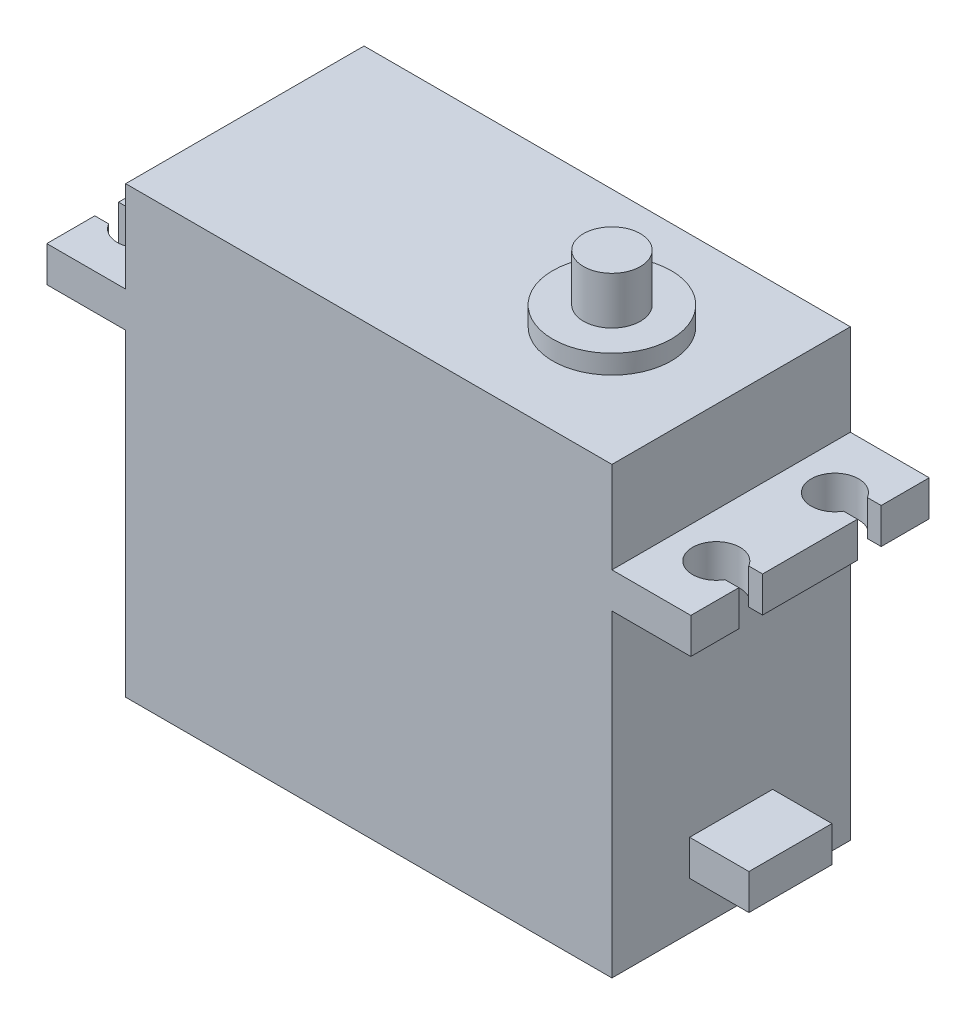
ISO-10303-21;
HEADER;
FILE_DESCRIPTION(('STEP AP214'),'2;1');
FILE_NAME('part.step','',(''),(''),'','','');
FILE_SCHEMA(('AUTOMOTIVE_DESIGN { 1 0 10303 214 1 1 1 1 }'));
ENDSEC;
DATA;
#1=APPLICATION_CONTEXT('core data for automotive mechanical design processes');
#2=APPLICATION_PROTOCOL_DEFINITION('international standard','automotive_design',2000,#1);
#3=PRODUCT_CONTEXT('',#1,'mechanical');
#4=PRODUCT('Part','Part','',(#3));
#5=PRODUCT_RELATED_PRODUCT_CATEGORY('part','',(#4));
#6=PRODUCT_DEFINITION_FORMATION('','',#4);
#7=PRODUCT_DEFINITION_CONTEXT('part definition',#1,'design');
#8=PRODUCT_DEFINITION('design','',#6,#7);
#9=PRODUCT_DEFINITION_SHAPE('','',#8);
#10=(LENGTH_UNIT() NAMED_UNIT(*) SI_UNIT(.MILLI.,.METRE.));
#11=(NAMED_UNIT(*) PLANE_ANGLE_UNIT() SI_UNIT($,.RADIAN.));
#12=(NAMED_UNIT(*) SI_UNIT($,.STERADIAN.) SOLID_ANGLE_UNIT());
#13=UNCERTAINTY_MEASURE_WITH_UNIT(LENGTH_MEASURE(1.E-05),#10,'distance_accuracy_value','');
#14=(GEOMETRIC_REPRESENTATION_CONTEXT(3) GLOBAL_UNCERTAINTY_ASSIGNED_CONTEXT((#13)) GLOBAL_UNIT_ASSIGNED_CONTEXT((#10,
#11,#12)) REPRESENTATION_CONTEXT('',''));
#15=CARTESIAN_POINT('',(0.,0.,0.));
#16=DIRECTION('',(0.,0.,1.));
#17=DIRECTION('',(1.,0.,0.));
#18=AXIS2_PLACEMENT_3D('',#15,#16,#17);
#19=CARTESIAN_POINT('',(10.05,26.8,10.05));
#20=DIRECTION('',(-1.,0.,0.));
#21=DIRECTION('',(0.,-1.,0.));
#22=AXIS2_PLACEMENT_3D('',#19,#20,#21);
#23=PLANE('',#22);
#24=DIRECTION('',(0.,1.,0.));
#25=VECTOR('',#24,1.);
#26=CARTESIAN_POINT('',(10.05,26.8,-10.05));
#27=LINE('',#26,#25);
#28=CARTESIAN_POINT('',(10.05,0.,-10.05));
#29=VERTEX_POINT('',#28);
#30=CARTESIAN_POINT('',(10.05,26.8,-10.05));
#31=VERTEX_POINT('',#30);
#32=EDGE_CURVE('E395',#29,#31,#27,.T.);
#33=ORIENTED_EDGE('',*,*,#32,.T.);
#34=DIRECTION('',(0.,0.,-1.));
#35=VECTOR('',#34,1.);
#36=CARTESIAN_POINT('',(10.05,26.8,10.05));
#37=LINE('',#36,#35);
#38=CARTESIAN_POINT('',(10.05,26.8,10.05));
#39=VERTEX_POINT('',#38);
#40=EDGE_CURVE('E456',#39,#31,#37,.T.);
#41=ORIENTED_EDGE('',*,*,#40,.F.);
#42=DIRECTION('',(0.,1.,0.));
#43=VECTOR('',#42,1.);
#44=CARTESIAN_POINT('',(10.05,26.8,10.05));
#45=LINE('',#44,#43);
#46=CARTESIAN_POINT('',(10.05,0.,10.05));
#47=VERTEX_POINT('',#46);
#48=EDGE_CURVE('E369',#47,#39,#45,.T.);
#49=ORIENTED_EDGE('',*,*,#48,.F.);
#50=DIRECTION('',(0.,0.,-1.));
#51=VECTOR('',#50,1.);
#52=CARTESIAN_POINT('',(10.05,0.,10.05));
#53=LINE('',#52,#51);
#54=EDGE_CURVE('E460',#47,#29,#53,.T.);
#55=ORIENTED_EDGE('',*,*,#54,.T.);
#56=EDGE_LOOP('',(#33,#41,#49,#55));
#57=FACE_BOUND('',#56,.T.);
#58=DIRECTION('',(0.,-1.,0.));
#59=VECTOR('',#58,1.);
#60=CARTESIAN_POINT('',(10.05,7.,3.5));
#61=LINE('',#60,#59);
#62=CARTESIAN_POINT('',(10.05,7.,3.5));
#63=VERTEX_POINT('',#62);
#64=CARTESIAN_POINT('',(10.05,4.,3.5));
#65=VERTEX_POINT('',#64);
#66=EDGE_CURVE('E264',#63,#65,#61,.T.);
#67=ORIENTED_EDGE('',*,*,#66,.F.);
#68=DIRECTION('',(0.,0.,1.));
#69=VECTOR('',#68,1.);
#70=CARTESIAN_POINT('',(10.05,7.,3.5));
#71=LINE('',#70,#69);
#72=CARTESIAN_POINT('',(10.05,7.,-3.5));
#73=VERTEX_POINT('',#72);
#74=EDGE_CURVE('E261',#73,#63,#71,.T.);
#75=ORIENTED_EDGE('',*,*,#74,.F.);
#76=DIRECTION('',(0.,1.,0.));
#77=VECTOR('',#76,1.);
#78=CARTESIAN_POINT('',(10.05,7.,-3.5));
#79=LINE('',#78,#77);
#80=CARTESIAN_POINT('',(10.05,4.,-3.5));
#81=VERTEX_POINT('',#80);
#82=EDGE_CURVE('E55',#81,#73,#79,.T.);
#83=ORIENTED_EDGE('',*,*,#82,.F.);
#84=DIRECTION('',(0.,0.,-1.));
#85=VECTOR('',#84,1.);
#86=CARTESIAN_POINT('',(10.05,4.,3.5));
#87=LINE('',#86,#85);
#88=EDGE_CURVE('E50',#65,#81,#87,.T.);
#89=ORIENTED_EDGE('',*,*,#88,.F.);
#90=EDGE_LOOP('',(#67,#75,#83,#89));
#91=FACE_BOUND('',#90,.T.);
#92=ADVANCED_FACE('F35',(#57,#91),#23,.F.);
#93=CARTESIAN_POINT('',(0.,39.1,0.));
#94=DIRECTION('',(0.,1.,0.));
#95=DIRECTION('',(0.,0.,1.));
#96=AXIS2_PLACEMENT_3D('',#93,#94,#95);
#97=PLANE('',#96);
#98=CARTESIAN_POINT('',(0.,39.1,0.));
#99=DIRECTION('',(0.,1.,0.));
#100=DIRECTION('',(0.,0.,1.));
#101=AXIS2_PLACEMENT_3D('',#98,#99,#100);
#102=CIRCLE('',#101,5.);
#103=CARTESIAN_POINT('',(0.,39.1,5.));
#104=VERTEX_POINT('',#103);
#105=EDGE_CURVE('E275',#104,#104,#102,.T.);
#106=ORIENTED_EDGE('',*,*,#105,.T.);
#107=EDGE_LOOP('',(#106));
#108=FACE_BOUND('',#107,.T.);
#109=CARTESIAN_POINT('',(0.,39.1,0.));
#110=DIRECTION('',(0.,1.,0.));
#111=DIRECTION('',(0.,0.,1.));
#112=AXIS2_PLACEMENT_3D('',#109,#110,#111);
#113=CIRCLE('',#112,2.4);
#114=CARTESIAN_POINT('',(0.,39.1,2.4));
#115=VERTEX_POINT('',#114);
#116=EDGE_CURVE('E265',#115,#115,#113,.T.);
#117=ORIENTED_EDGE('',*,*,#116,.F.);
#118=EDGE_LOOP('',(#117));
#119=FACE_BOUND('',#118,.T.);
#120=ADVANCED_FACE('F550',(#108,#119),#97,.T.);
#121=CARTESIAN_POINT('',(-30.95,37.5,10.05));
#122=DIRECTION('',(0.,-1.,0.));
#123=DIRECTION('',(0.,0.,-1.));
#124=AXIS2_PLACEMENT_3D('',#121,#122,#123);
#125=PLANE('',#124);
#126=DIRECTION('',(-1.,0.,0.));
#127=VECTOR('',#126,1.);
#128=CARTESIAN_POINT('',(-30.95,37.5,-10.05));
#129=LINE('',#128,#127);
#130=CARTESIAN_POINT('',(10.05,37.5,-10.05));
#131=VERTEX_POINT('',#130);
#132=CARTESIAN_POINT('',(-30.95,37.5,-10.05));
#133=VERTEX_POINT('',#132);
#134=EDGE_CURVE('E407',#131,#133,#129,.T.);
#135=ORIENTED_EDGE('',*,*,#134,.T.);
#136=DIRECTION('',(0.,0.,-1.));
#137=VECTOR('',#136,1.);
#138=CARTESIAN_POINT('',(-30.95,37.5,10.05));
#139=LINE('',#138,#137);
#140=CARTESIAN_POINT('',(-30.95,37.5,10.05));
#141=VERTEX_POINT('',#140);
#142=EDGE_CURVE('E438',#141,#133,#139,.T.);
#143=ORIENTED_EDGE('',*,*,#142,.F.);
#144=DIRECTION('',(-1.,0.,0.));
#145=VECTOR('',#144,1.);
#146=CARTESIAN_POINT('',(-30.95,37.5,10.05));
#147=LINE('',#146,#145);
#148=CARTESIAN_POINT('',(10.05,37.5,10.05));
#149=VERTEX_POINT('',#148);
#150=EDGE_CURVE('E380',#149,#141,#147,.T.);
#151=ORIENTED_EDGE('',*,*,#150,.F.);
#152=DIRECTION('',(0.,0.,-1.));
#153=VECTOR('',#152,1.);
#154=CARTESIAN_POINT('',(10.05,37.5,10.05));
#155=LINE('',#154,#153);
#156=EDGE_CURVE('E441',#149,#131,#155,.T.);
#157=ORIENTED_EDGE('',*,*,#156,.T.);
#158=EDGE_LOOP('',(#135,#143,#151,#157));
#159=FACE_BOUND('',#158,.T.);
#160=CARTESIAN_POINT('',(0.,37.5,0.));
#161=DIRECTION('',(0.,-1.,0.));
#162=DIRECTION('',(0.,0.,-1.));
#163=AXIS2_PLACEMENT_3D('',#160,#161,#162);
#164=CIRCLE('',#163,5.);
#165=CARTESIAN_POINT('',(0.,37.5,-5.));
#166=VERTEX_POINT('',#165);
#167=EDGE_CURVE('E11',#166,#166,#164,.F.);
#168=ORIENTED_EDGE('',*,*,#167,.F.);
#169=EDGE_LOOP('',(#168));
#170=FACE_BOUND('',#169,.T.);
#171=ADVANCED_FACE('F555',(#159,#170),#125,.F.);
#172=CARTESIAN_POINT('',(16.7,29.8,10.05));
#173=DIRECTION('',(-1.,0.,0.));
#174=DIRECTION('',(0.,0.,1.));
#175=AXIS2_PLACEMENT_3D('',#172,#173,#174);
#176=PLANE('',#175);
#177=DIRECTION('',(0.,0.,-1.));
#178=VECTOR('',#177,1.);
#179=CARTESIAN_POINT('',(16.7,26.8,10.05));
#180=LINE('',#179,#178);
#181=CARTESIAN_POINT('',(16.7,26.8,3.99999999999999));
#182=VERTEX_POINT('',#181);
#183=CARTESIAN_POINT('',(16.7,26.8,-4.));
#184=VERTEX_POINT('',#183);
#185=EDGE_CURVE('E457',#182,#184,#180,.T.);
#186=ORIENTED_EDGE('',*,*,#185,.T.);
#187=DIRECTION('',(0.,1.,0.));
#188=VECTOR('',#187,1.);
#189=CARTESIAN_POINT('',(16.7,0.,-4.));
#190=LINE('',#189,#188);
#191=CARTESIAN_POINT('',(16.7,29.8,-4.));
#192=VERTEX_POINT('',#191);
#193=EDGE_CURVE('E288',#184,#192,#190,.T.);
#194=ORIENTED_EDGE('',*,*,#193,.T.);
#195=DIRECTION('',(0.,0.,-1.));
#196=VECTOR('',#195,1.);
#197=CARTESIAN_POINT('',(16.7,29.8,10.05));
#198=LINE('',#197,#196);
#199=CARTESIAN_POINT('',(16.7,29.8,4.));
#200=VERTEX_POINT('',#199);
#201=EDGE_CURVE('E452',#200,#192,#198,.T.);
#202=ORIENTED_EDGE('',*,*,#201,.F.);
#203=DIRECTION('',(0.,1.,0.));
#204=VECTOR('',#203,1.);
#205=CARTESIAN_POINT('',(16.7,0.,3.99999999999999));
#206=LINE('',#205,#204);
#207=EDGE_CURVE('E347',#182,#200,#206,.T.);
#208=ORIENTED_EDGE('',*,*,#207,.F.);
#209=EDGE_LOOP('',(#186,#194,#202,#208));
#210=FACE_BOUND('',#209,.T.);
#211=ADVANCED_FACE('F568',(#210),#176,.F.);
#212=CARTESIAN_POINT('',(-37.6,26.8,10.05));
#213=DIRECTION('',(1.,0.,0.));
#214=DIRECTION('',(0.,0.,-1.));
#215=AXIS2_PLACEMENT_3D('',#212,#213,#214);
#216=PLANE('',#215);
#217=DIRECTION('',(0.,0.,-1.));
#218=VECTOR('',#217,1.);
#219=CARTESIAN_POINT('',(-37.6,29.8,10.05));
#220=LINE('',#219,#218);
#221=CARTESIAN_POINT('',(-37.6,29.8,4.));
#222=VERTEX_POINT('',#221);
#223=CARTESIAN_POINT('',(-37.6,29.8,-3.99999999999999));
#224=VERTEX_POINT('',#223);
#225=EDGE_CURVE('E435',#222,#224,#220,.T.);
#226=ORIENTED_EDGE('',*,*,#225,.T.);
#227=DIRECTION('',(0.,1.,0.));
#228=VECTOR('',#227,1.);
#229=CARTESIAN_POINT('',(-37.6,0.,-3.99999999999999));
#230=LINE('',#229,#228);
#231=CARTESIAN_POINT('',(-37.6,26.8,-3.99999999999999));
#232=VERTEX_POINT('',#231);
#233=EDGE_CURVE('E314',#232,#224,#230,.T.);
#234=ORIENTED_EDGE('',*,*,#233,.F.);
#235=DIRECTION('',(0.,0.,-1.));
#236=VECTOR('',#235,1.);
#237=CARTESIAN_POINT('',(-37.6,26.8,10.05));
#238=LINE('',#237,#236);
#239=CARTESIAN_POINT('',(-37.6,26.8,4.));
#240=VERTEX_POINT('',#239);
#241=EDGE_CURVE('E430',#240,#232,#238,.T.);
#242=ORIENTED_EDGE('',*,*,#241,.F.);
#243=DIRECTION('',(0.,1.,0.));
#244=VECTOR('',#243,1.);
#245=CARTESIAN_POINT('',(-37.6,0.,4.));
#246=LINE('',#245,#244);
#247=EDGE_CURVE('E330',#240,#222,#246,.T.);
#248=ORIENTED_EDGE('',*,*,#247,.T.);
#249=EDGE_LOOP('',(#226,#234,#242,#248));
#250=FACE_BOUND('',#249,.T.);
#251=ADVANCED_FACE('F489',(#250),#216,.F.);
#252=CARTESIAN_POINT('',(-37.6,26.8,-6.));
#253=VERTEX_POINT('',#252);
#254=CARTESIAN_POINT('',(-37.6,26.8,-10.05));
#255=VERTEX_POINT('',#254);
#256=EDGE_CURVE('E425',#253,#255,#238,.T.);
#257=ORIENTED_EDGE('',*,*,#256,.F.);
#258=DIRECTION('',(0.,1.,0.));
#259=VECTOR('',#258,1.);
#260=CARTESIAN_POINT('',(-37.6,0.,-6.));
#261=LINE('',#260,#259);
#262=CARTESIAN_POINT('',(-37.6,29.8,-6.));
#263=VERTEX_POINT('',#262);
#264=EDGE_CURVE('E317',#253,#263,#261,.T.);
#265=ORIENTED_EDGE('',*,*,#264,.T.);
#266=CARTESIAN_POINT('',(-37.6,29.8,-10.05));
#267=VERTEX_POINT('',#266);
#268=EDGE_CURVE('E429',#263,#267,#220,.T.);
#269=ORIENTED_EDGE('',*,*,#268,.T.);
#270=DIRECTION('',(0.,-1.,0.));
#271=VECTOR('',#270,1.);
#272=CARTESIAN_POINT('',(-37.6,26.8,-10.05));
#273=LINE('',#272,#271);
#274=EDGE_CURVE('E414',#267,#255,#273,.T.);
#275=ORIENTED_EDGE('',*,*,#274,.T.);
#276=EDGE_LOOP('',(#257,#265,#269,#275));
#277=FACE_BOUND('',#276,.T.);
#278=ADVANCED_FACE('F496',(#277),#216,.F.);
#279=CARTESIAN_POINT('',(16.7,26.8,10.05));
#280=VERTEX_POINT('',#279);
#281=CARTESIAN_POINT('',(16.7,26.8,6.));
#282=VERTEX_POINT('',#281);
#283=EDGE_CURVE('E453',#280,#282,#180,.T.);
#284=ORIENTED_EDGE('',*,*,#283,.T.);
#285=DIRECTION('',(0.,1.,0.));
#286=VECTOR('',#285,1.);
#287=CARTESIAN_POINT('',(16.7,0.,6.));
#288=LINE('',#287,#286);
#289=CARTESIAN_POINT('',(16.7,29.8,6.));
#290=VERTEX_POINT('',#289);
#291=EDGE_CURVE('E348',#282,#290,#288,.T.);
#292=ORIENTED_EDGE('',*,*,#291,.T.);
#293=CARTESIAN_POINT('',(16.7,29.8,10.05));
#294=VERTEX_POINT('',#293);
#295=EDGE_CURVE('E448',#294,#290,#198,.T.);
#296=ORIENTED_EDGE('',*,*,#295,.F.);
#297=DIRECTION('',(0.,1.,0.));
#298=VECTOR('',#297,1.);
#299=CARTESIAN_POINT('',(16.7,29.8,10.05));
#300=LINE('',#299,#298);
#301=EDGE_CURVE('E374',#280,#294,#300,.T.);
#302=ORIENTED_EDGE('',*,*,#301,.F.);
#303=EDGE_LOOP('',(#284,#292,#296,#302));
#304=FACE_BOUND('',#303,.T.);
#305=ADVANCED_FACE('F569',(#304),#176,.F.);
#306=CARTESIAN_POINT('',(10.05,0.,10.05));
#307=DIRECTION('',(0.,1.,0.));
#308=DIRECTION('',(0.,0.,1.));
#309=AXIS2_PLACEMENT_3D('',#306,#307,#308);
#310=PLANE('',#309);
#311=DIRECTION('',(1.,0.,0.));
#312=VECTOR('',#311,1.);
#313=CARTESIAN_POINT('',(10.05,0.,-10.05));
#314=LINE('',#313,#312);
#315=CARTESIAN_POINT('',(-30.95,0.,-10.05));
#316=VERTEX_POINT('',#315);
#317=EDGE_CURVE('E365',#316,#29,#314,.T.);
#318=ORIENTED_EDGE('',*,*,#317,.T.);
#319=ORIENTED_EDGE('',*,*,#54,.F.);
#320=DIRECTION('',(1.,0.,0.));
#321=VECTOR('',#320,1.);
#322=CARTESIAN_POINT('',(10.05,0.,10.05));
#323=LINE('',#322,#321);
#324=CARTESIAN_POINT('',(-30.95,0.,10.05));
#325=VERTEX_POINT('',#324);
#326=EDGE_CURVE('E366',#325,#47,#323,.T.);
#327=ORIENTED_EDGE('',*,*,#326,.F.);
#328=DIRECTION('',(0.,0.,-1.));
#329=VECTOR('',#328,1.);
#330=CARTESIAN_POINT('',(-30.95,0.,10.05));
#331=LINE('',#330,#329);
#332=EDGE_CURVE('E392',#325,#316,#331,.T.);
#333=ORIENTED_EDGE('',*,*,#332,.T.);
#334=EDGE_LOOP('',(#318,#319,#327,#333));
#335=FACE_BOUND('',#334,.T.);
#336=ADVANCED_FACE('F37',(#335),#310,.F.);
#337=CARTESIAN_POINT('',(16.7,26.8,10.05));
#338=DIRECTION('',(0.,1.,0.));
#339=DIRECTION('',(-1.,0.,0.));
#340=AXIS2_PLACEMENT_3D('',#337,#338,#339);
#341=PLANE('',#340);
#342=CARTESIAN_POINT('',(13.8,26.8,-5.));
#343=DIRECTION('',(0.,1.,0.));
#344=DIRECTION('',(-1.,0.,0.));
#345=AXIS2_PLACEMENT_3D('',#342,#343,#344);
#346=CIRCLE('',#345,2.);
#347=CARTESIAN_POINT('',(15.5320508075689,26.8,-6.));
#348=VERTEX_POINT('',#347);
#349=CARTESIAN_POINT('',(15.5320508075689,26.8,-4.));
#350=VERTEX_POINT('',#349);
#351=EDGE_CURVE('E299',#348,#350,#346,.T.);
#352=ORIENTED_EDGE('',*,*,#351,.T.);
#353=DIRECTION('',(1.,0.,0.));
#354=VECTOR('',#353,1.);
#355=CARTESIAN_POINT('',(16.7,26.8,-4.));
#356=LINE('',#355,#354);
#357=EDGE_CURVE('E302',#350,#184,#356,.T.);
#358=ORIENTED_EDGE('',*,*,#357,.T.);
#359=ORIENTED_EDGE('',*,*,#185,.F.);
#360=DIRECTION('',(-1.,0.,0.));
#361=VECTOR('',#360,1.);
#362=CARTESIAN_POINT('',(16.7,26.8,3.99999999999999));
#363=LINE('',#362,#361);
#364=CARTESIAN_POINT('',(15.5320508075689,26.8,4.));
#365=VERTEX_POINT('',#364);
#366=EDGE_CURVE('E351',#182,#365,#363,.T.);
#367=ORIENTED_EDGE('',*,*,#366,.T.);
#368=CARTESIAN_POINT('',(13.8,26.8,5.));
#369=DIRECTION('',(0.,1.,0.));
#370=DIRECTION('',(-1.,0.,0.));
#371=AXIS2_PLACEMENT_3D('',#368,#369,#370);
#372=CIRCLE('',#371,2.);
#373=CARTESIAN_POINT('',(15.5320508075689,26.8,5.99999999999999));
#374=VERTEX_POINT('',#373);
#375=EDGE_CURVE('E359',#365,#374,#372,.T.);
#376=ORIENTED_EDGE('',*,*,#375,.T.);
#377=DIRECTION('',(1.,0.,0.));
#378=VECTOR('',#377,1.);
#379=CARTESIAN_POINT('',(16.7,26.8,6.));
#380=LINE('',#379,#378);
#381=EDGE_CURVE('E362',#374,#282,#380,.T.);
#382=ORIENTED_EDGE('',*,*,#381,.T.);
#383=ORIENTED_EDGE('',*,*,#283,.F.);
#384=DIRECTION('',(1.,0.,0.));
#385=VECTOR('',#384,1.);
#386=CARTESIAN_POINT('',(16.7,26.8,10.05));
#387=LINE('',#386,#385);
#388=EDGE_CURVE('E372',#39,#280,#387,.T.);
#389=ORIENTED_EDGE('',*,*,#388,.F.);
#390=ORIENTED_EDGE('',*,*,#40,.T.);
#391=DIRECTION('',(1.,0.,0.));
#392=VECTOR('',#391,1.);
#393=CARTESIAN_POINT('',(16.7,26.8,-10.05));
#394=LINE('',#393,#392);
#395=CARTESIAN_POINT('',(16.7,26.8,-10.05));
#396=VERTEX_POINT('',#395);
#397=EDGE_CURVE('E397',#31,#396,#394,.T.);
#398=ORIENTED_EDGE('',*,*,#397,.T.);
#399=CARTESIAN_POINT('',(16.7,26.8,-6.));
#400=VERTEX_POINT('',#399);
#401=EDGE_CURVE('E451',#400,#396,#180,.T.);
#402=ORIENTED_EDGE('',*,*,#401,.F.);
#403=DIRECTION('',(-1.,0.,0.));
#404=VECTOR('',#403,1.);
#405=CARTESIAN_POINT('',(16.7,26.8,-6.));
#406=LINE('',#405,#404);
#407=EDGE_CURVE('E291',#400,#348,#406,.T.);
#408=ORIENTED_EDGE('',*,*,#407,.T.);
#409=EDGE_LOOP('',(#352,#358,#359,#367,#376,#382,#383,#389,#390,#398,#402,#408));
#410=FACE_BOUND('',#409,.T.);
#411=ADVANCED_FACE('F559',(#410),#341,.F.);
#412=CARTESIAN_POINT('',(16.7,29.8,-6.));
#413=VERTEX_POINT('',#412);
#414=CARTESIAN_POINT('',(16.7,29.8,-10.05));
#415=VERTEX_POINT('',#414);
#416=EDGE_CURVE('E447',#413,#415,#198,.T.);
#417=ORIENTED_EDGE('',*,*,#416,.F.);
#418=DIRECTION('',(0.,1.,0.));
#419=VECTOR('',#418,1.);
#420=CARTESIAN_POINT('',(16.7,0.,-6.));
#421=LINE('',#420,#419);
#422=EDGE_CURVE('E287',#400,#413,#421,.T.);
#423=ORIENTED_EDGE('',*,*,#422,.F.);
#424=ORIENTED_EDGE('',*,*,#401,.T.);
#425=DIRECTION('',(0.,1.,0.));
#426=VECTOR('',#425,1.);
#427=CARTESIAN_POINT('',(16.7,29.8,-10.05));
#428=LINE('',#427,#426);
#429=EDGE_CURVE('E400',#396,#415,#428,.T.);
#430=ORIENTED_EDGE('',*,*,#429,.T.);
#431=EDGE_LOOP('',(#417,#423,#424,#430));
#432=FACE_BOUND('',#431,.T.);
#433=ADVANCED_FACE('F562',(#432),#176,.F.);
#434=CARTESIAN_POINT('',(10.05,29.8,10.05));
#435=DIRECTION('',(0.,-1.,0.));
#436=DIRECTION('',(1.,0.,0.));
#437=AXIS2_PLACEMENT_3D('',#434,#435,#436);
#438=PLANE('',#437);
#439=ORIENTED_EDGE('',*,*,#201,.T.);
#440=DIRECTION('',(1.,0.,0.));
#441=VECTOR('',#440,1.);
#442=CARTESIAN_POINT('',(16.7,29.8,-4.));
#443=LINE('',#442,#441);
#444=CARTESIAN_POINT('',(15.5320508075689,29.8,-4.));
#445=VERTEX_POINT('',#444);
#446=EDGE_CURVE('E285',#445,#192,#443,.T.);
#447=ORIENTED_EDGE('',*,*,#446,.F.);
#448=CARTESIAN_POINT('',(13.8,29.8,-5.));
#449=DIRECTION('',(0.,1.,0.));
#450=DIRECTION('',(0.,0.,1.));
#451=AXIS2_PLACEMENT_3D('',#448,#449,#450);
#452=CIRCLE('',#451,2.);
#453=CARTESIAN_POINT('',(15.5320508075689,29.8,-6.));
#454=VERTEX_POINT('',#453);
#455=EDGE_CURVE('E282',#454,#445,#452,.T.);
#456=ORIENTED_EDGE('',*,*,#455,.F.);
#457=DIRECTION('',(-1.,0.,0.));
#458=VECTOR('',#457,1.);
#459=CARTESIAN_POINT('',(16.7,29.8,-6.));
#460=LINE('',#459,#458);
#461=EDGE_CURVE('E279',#413,#454,#460,.T.);
#462=ORIENTED_EDGE('',*,*,#461,.F.);
#463=ORIENTED_EDGE('',*,*,#416,.T.);
#464=DIRECTION('',(-1.,0.,0.));
#465=VECTOR('',#464,1.);
#466=CARTESIAN_POINT('',(10.05,29.8,-10.05));
#467=LINE('',#466,#465);
#468=CARTESIAN_POINT('',(10.05,29.8,-10.05));
#469=VERTEX_POINT('',#468);
#470=EDGE_CURVE('E403',#415,#469,#467,.T.);
#471=ORIENTED_EDGE('',*,*,#470,.T.);
#472=DIRECTION('',(0.,0.,-1.));
#473=VECTOR('',#472,1.);
#474=CARTESIAN_POINT('',(10.05,29.8,10.05));
#475=LINE('',#474,#473);
#476=CARTESIAN_POINT('',(10.05,29.8,10.05));
#477=VERTEX_POINT('',#476);
#478=EDGE_CURVE('E444',#477,#469,#475,.T.);
#479=ORIENTED_EDGE('',*,*,#478,.F.);
#480=DIRECTION('',(-1.,0.,0.));
#481=VECTOR('',#480,1.);
#482=CARTESIAN_POINT('',(10.05,29.8,10.05));
#483=LINE('',#482,#481);
#484=EDGE_CURVE('E376',#294,#477,#483,.T.);
#485=ORIENTED_EDGE('',*,*,#484,.F.);
#486=ORIENTED_EDGE('',*,*,#295,.T.);
#487=DIRECTION('',(1.,0.,0.));
#488=VECTOR('',#487,1.);
#489=CARTESIAN_POINT('',(16.7,29.8,6.));
#490=LINE('',#489,#488);
#491=CARTESIAN_POINT('',(15.5320508075689,29.8,5.99999999999999));
#492=VERTEX_POINT('',#491);
#493=EDGE_CURVE('E345',#492,#290,#490,.T.);
#494=ORIENTED_EDGE('',*,*,#493,.F.);
#495=CARTESIAN_POINT('',(13.8,29.8,5.));
#496=DIRECTION('',(0.,1.,0.));
#497=DIRECTION('',(0.,0.,1.));
#498=AXIS2_PLACEMENT_3D('',#495,#496,#497);
#499=CIRCLE('',#498,2.);
#500=CARTESIAN_POINT('',(15.5320508075689,29.8,4.));
#501=VERTEX_POINT('',#500);
#502=EDGE_CURVE('E342',#501,#492,#499,.T.);
#503=ORIENTED_EDGE('',*,*,#502,.F.);
#504=DIRECTION('',(-1.,0.,0.));
#505=VECTOR('',#504,1.);
#506=CARTESIAN_POINT('',(16.7,29.8,3.99999999999999));
#507=LINE('',#506,#505);
#508=EDGE_CURVE('E333',#200,#501,#507,.T.);
#509=ORIENTED_EDGE('',*,*,#508,.F.);
#510=EDGE_LOOP('',(#439,#447,#456,#462,#463,#471,#479,#485,#486,#494,#503,#509));
#511=FACE_BOUND('',#510,.T.);
#512=ADVANCED_FACE('F566',(#511),#438,.F.);
#513=CARTESIAN_POINT('',(10.05,37.5,10.05));
#514=DIRECTION('',(-1.,0.,0.));
#515=DIRECTION('',(0.,0.,1.));
#516=AXIS2_PLACEMENT_3D('',#513,#514,#515);
#517=PLANE('',#516);
#518=DIRECTION('',(0.,1.,0.));
#519=VECTOR('',#518,1.);
#520=CARTESIAN_POINT('',(10.05,37.5,-10.05));
#521=LINE('',#520,#519);
#522=EDGE_CURVE('E405',#469,#131,#521,.T.);
#523=ORIENTED_EDGE('',*,*,#522,.T.);
#524=ORIENTED_EDGE('',*,*,#156,.F.);
#525=DIRECTION('',(0.,1.,0.));
#526=VECTOR('',#525,1.);
#527=CARTESIAN_POINT('',(10.05,37.5,10.05));
#528=LINE('',#527,#526);
#529=EDGE_CURVE('E378',#477,#149,#528,.T.);
#530=ORIENTED_EDGE('',*,*,#529,.F.);
#531=ORIENTED_EDGE('',*,*,#478,.T.);
#532=EDGE_LOOP('',(#523,#524,#530,#531));
#533=FACE_BOUND('',#532,.T.);
#534=ADVANCED_FACE('F572',(#533),#517,.F.);
#535=CARTESIAN_POINT('',(-30.95,29.8,10.05));
#536=DIRECTION('',(1.,0.,0.));
#537=DIRECTION('',(0.,0.,-1.));
#538=AXIS2_PLACEMENT_3D('',#535,#536,#537);
#539=PLANE('',#538);
#540=DIRECTION('',(0.,-1.,0.));
#541=VECTOR('',#540,1.);
#542=CARTESIAN_POINT('',(-30.95,29.8,-10.05));
#543=LINE('',#542,#541);
#544=CARTESIAN_POINT('',(-30.95,29.8,-10.05));
#545=VERTEX_POINT('',#544);
#546=EDGE_CURVE('E409',#133,#545,#543,.T.);
#547=ORIENTED_EDGE('',*,*,#546,.T.);
#548=DIRECTION('',(0.,0.,-1.));
#549=VECTOR('',#548,1.);
#550=CARTESIAN_POINT('',(-30.95,29.8,10.05));
#551=LINE('',#550,#549);
#552=CARTESIAN_POINT('',(-30.95,29.8,10.05));
#553=VERTEX_POINT('',#552);
#554=EDGE_CURVE('E434',#553,#545,#551,.T.);
#555=ORIENTED_EDGE('',*,*,#554,.F.);
#556=DIRECTION('',(0.,-1.,0.));
#557=VECTOR('',#556,1.);
#558=CARTESIAN_POINT('',(-30.95,29.8,10.05));
#559=LINE('',#558,#557);
#560=EDGE_CURVE('E382',#141,#553,#559,.T.);
#561=ORIENTED_EDGE('',*,*,#560,.F.);
#562=ORIENTED_EDGE('',*,*,#142,.T.);
#563=EDGE_LOOP('',(#547,#555,#561,#562));
#564=FACE_BOUND('',#563,.T.);
#565=ADVANCED_FACE('F576',(#564),#539,.F.);
#566=CARTESIAN_POINT('',(-37.6,29.8,10.05));
#567=DIRECTION('',(0.,-1.,0.));
#568=DIRECTION('',(0.,0.,-1.));
#569=AXIS2_PLACEMENT_3D('',#566,#567,#568);
#570=PLANE('',#569);
#571=CARTESIAN_POINT('',(-34.7,29.8,-5.));
#572=DIRECTION('',(0.,1.,0.));
#573=DIRECTION('',(0.,0.,1.));
#574=AXIS2_PLACEMENT_3D('',#571,#572,#573);
#575=CIRCLE('',#574,2.);
#576=CARTESIAN_POINT('',(-36.4320508075689,29.8,-4.));
#577=VERTEX_POINT('',#576);
#578=CARTESIAN_POINT('',(-36.4320508075689,29.8,-5.99999999999999));
#579=VERTEX_POINT('',#578);
#580=EDGE_CURVE('E308',#577,#579,#575,.T.);
#581=ORIENTED_EDGE('',*,*,#580,.F.);
#582=DIRECTION('',(1.,0.,0.));
#583=VECTOR('',#582,1.);
#584=CARTESIAN_POINT('',(-37.6,29.8,-3.99999999999999));
#585=LINE('',#584,#583);
#586=EDGE_CURVE('E305',#224,#577,#585,.T.);
#587=ORIENTED_EDGE('',*,*,#586,.F.);
#588=ORIENTED_EDGE('',*,*,#225,.F.);
#589=DIRECTION('',(-1.,0.,0.));
#590=VECTOR('',#589,1.);
#591=CARTESIAN_POINT('',(-37.6,29.8,4.));
#592=LINE('',#591,#590);
#593=CARTESIAN_POINT('',(-36.4320508075689,29.8,4.));
#594=VERTEX_POINT('',#593);
#595=EDGE_CURVE('E316',#594,#222,#592,.T.);
#596=ORIENTED_EDGE('',*,*,#595,.F.);
#597=CARTESIAN_POINT('',(-34.7,29.8,5.));
#598=DIRECTION('',(0.,1.,0.));
#599=DIRECTION('',(0.,0.,1.));
#600=AXIS2_PLACEMENT_3D('',#597,#598,#599);
#601=CIRCLE('',#600,2.);
#602=CARTESIAN_POINT('',(-36.4320508075689,29.8,6.));
#603=VERTEX_POINT('',#602);
#604=EDGE_CURVE('E327',#603,#594,#601,.T.);
#605=ORIENTED_EDGE('',*,*,#604,.F.);
#606=DIRECTION('',(1.,0.,0.));
#607=VECTOR('',#606,1.);
#608=CARTESIAN_POINT('',(-37.6,29.8,6.));
#609=LINE('',#608,#607);
#610=CARTESIAN_POINT('',(-37.6,29.8,6.));
#611=VERTEX_POINT('',#610);
#612=EDGE_CURVE('E324',#611,#603,#609,.T.);
#613=ORIENTED_EDGE('',*,*,#612,.F.);
#614=CARTESIAN_POINT('',(-37.6,29.8,10.05));
#615=VERTEX_POINT('',#614);
#616=EDGE_CURVE('E431',#615,#611,#220,.T.);
#617=ORIENTED_EDGE('',*,*,#616,.F.);
#618=DIRECTION('',(-1.,0.,0.));
#619=VECTOR('',#618,1.);
#620=CARTESIAN_POINT('',(-37.6,29.8,10.05));
#621=LINE('',#620,#619);
#622=EDGE_CURVE('E384',#553,#615,#621,.T.);
#623=ORIENTED_EDGE('',*,*,#622,.F.);
#624=ORIENTED_EDGE('',*,*,#554,.T.);
#625=DIRECTION('',(-1.,0.,0.));
#626=VECTOR('',#625,1.);
#627=CARTESIAN_POINT('',(-37.6,29.8,-10.05));
#628=LINE('',#627,#626);
#629=EDGE_CURVE('E411',#545,#267,#628,.T.);
#630=ORIENTED_EDGE('',*,*,#629,.T.);
#631=ORIENTED_EDGE('',*,*,#268,.F.);
#632=DIRECTION('',(-1.,0.,0.));
#633=VECTOR('',#632,1.);
#634=CARTESIAN_POINT('',(-37.6,29.8,-6.));
#635=LINE('',#634,#633);
#636=EDGE_CURVE('E311',#579,#263,#635,.T.);
#637=ORIENTED_EDGE('',*,*,#636,.F.);
#638=EDGE_LOOP('',(#581,#587,#588,#596,#605,#613,#617,#623,#624,#630,#631,#637));
#639=FACE_BOUND('',#638,.T.);
#640=ADVANCED_FACE('F502',(#639),#570,.F.);
#641=ORIENTED_EDGE('',*,*,#616,.T.);
#642=DIRECTION('',(0.,1.,0.));
#643=VECTOR('',#642,1.);
#644=CARTESIAN_POINT('',(-37.6,0.,6.));
#645=LINE('',#644,#643);
#646=CARTESIAN_POINT('',(-37.6,26.8,6.));
#647=VERTEX_POINT('',#646);
#648=EDGE_CURVE('E336',#647,#611,#645,.T.);
#649=ORIENTED_EDGE('',*,*,#648,.F.);
#650=CARTESIAN_POINT('',(-37.6,26.8,10.05));
#651=VERTEX_POINT('',#650);
#652=EDGE_CURVE('E426',#651,#647,#238,.T.);
#653=ORIENTED_EDGE('',*,*,#652,.F.);
#654=DIRECTION('',(0.,-1.,0.));
#655=VECTOR('',#654,1.);
#656=CARTESIAN_POINT('',(-37.6,26.8,10.05));
#657=LINE('',#656,#655);
#658=EDGE_CURVE('E386',#615,#651,#657,.T.);
#659=ORIENTED_EDGE('',*,*,#658,.F.);
#660=EDGE_LOOP('',(#641,#649,#653,#659));
#661=FACE_BOUND('',#660,.T.);
#662=ADVANCED_FACE('F524',(#661),#216,.F.);
#663=CARTESIAN_POINT('',(-30.95,26.8,10.05));
#664=DIRECTION('',(0.,1.,0.));
#665=DIRECTION('',(0.,0.,1.));
#666=AXIS2_PLACEMENT_3D('',#663,#664,#665);
#667=PLANE('',#666);
#668=ORIENTED_EDGE('',*,*,#241,.T.);
#669=DIRECTION('',(1.,0.,0.));
#670=VECTOR('',#669,1.);
#671=CARTESIAN_POINT('',(-30.95,26.8,-4.));
#672=LINE('',#671,#670);
#673=CARTESIAN_POINT('',(-36.4320508075689,26.8,-4.));
#674=VERTEX_POINT('',#673);
#675=EDGE_CURVE('E43',#232,#674,#672,.T.);
#676=ORIENTED_EDGE('',*,*,#675,.T.);
#677=CARTESIAN_POINT('',(-34.7,26.8,-5.));
#678=DIRECTION('',(0.,1.,0.));
#679=DIRECTION('',(0.,0.,1.));
#680=AXIS2_PLACEMENT_3D('',#677,#678,#679);
#681=CIRCLE('',#680,2.);
#682=CARTESIAN_POINT('',(-36.4320508075689,26.8,-5.99999999999999));
#683=VERTEX_POINT('',#682);
#684=EDGE_CURVE('E472',#674,#683,#681,.T.);
#685=ORIENTED_EDGE('',*,*,#684,.T.);
#686=DIRECTION('',(-1.,0.,0.));
#687=VECTOR('',#686,1.);
#688=CARTESIAN_POINT('',(-30.95,26.8,-5.99999999999999));
#689=LINE('',#688,#687);
#690=EDGE_CURVE('E475',#683,#253,#689,.T.);
#691=ORIENTED_EDGE('',*,*,#690,.T.);
#692=ORIENTED_EDGE('',*,*,#256,.T.);
#693=DIRECTION('',(1.,0.,0.));
#694=VECTOR('',#693,1.);
#695=CARTESIAN_POINT('',(-30.95,26.8,-10.05));
#696=LINE('',#695,#694);
#697=CARTESIAN_POINT('',(-30.95,26.8,-10.05));
#698=VERTEX_POINT('',#697);
#699=EDGE_CURVE('E417',#255,#698,#696,.T.);
#700=ORIENTED_EDGE('',*,*,#699,.T.);
#701=DIRECTION('',(0.,0.,-1.));
#702=VECTOR('',#701,1.);
#703=CARTESIAN_POINT('',(-30.95,26.8,10.05));
#704=LINE('',#703,#702);
#705=CARTESIAN_POINT('',(-30.95,26.8,10.05));
#706=VERTEX_POINT('',#705);
#707=EDGE_CURVE('E422',#706,#698,#704,.T.);
#708=ORIENTED_EDGE('',*,*,#707,.F.);
#709=DIRECTION('',(1.,0.,0.));
#710=VECTOR('',#709,1.);
#711=CARTESIAN_POINT('',(-30.95,26.8,10.05));
#712=LINE('',#711,#710);
#713=EDGE_CURVE('E388',#651,#706,#712,.T.);
#714=ORIENTED_EDGE('',*,*,#713,.F.);
#715=ORIENTED_EDGE('',*,*,#652,.T.);
#716=DIRECTION('',(1.,0.,0.));
#717=VECTOR('',#716,1.);
#718=CARTESIAN_POINT('',(-30.95,26.8,6.));
#719=LINE('',#718,#717);
#720=CARTESIAN_POINT('',(-36.4320508075689,26.8,6.));
#721=VERTEX_POINT('',#720);
#722=EDGE_CURVE('E463',#647,#721,#719,.T.);
#723=ORIENTED_EDGE('',*,*,#722,.T.);
#724=CARTESIAN_POINT('',(-34.7,26.8,5.));
#725=DIRECTION('',(0.,1.,0.));
#726=DIRECTION('',(0.,0.,1.));
#727=AXIS2_PLACEMENT_3D('',#724,#725,#726);
#728=CIRCLE('',#727,2.);
#729=CARTESIAN_POINT('',(-36.4320508075689,26.8,4.));
#730=VERTEX_POINT('',#729);
#731=EDGE_CURVE('E466',#721,#730,#728,.T.);
#732=ORIENTED_EDGE('',*,*,#731,.T.);
#733=DIRECTION('',(-1.,0.,0.));
#734=VECTOR('',#733,1.);
#735=CARTESIAN_POINT('',(-30.95,26.8,4.00000000000001));
#736=LINE('',#735,#734);
#737=EDGE_CURVE('E469',#730,#240,#736,.T.);
#738=ORIENTED_EDGE('',*,*,#737,.T.);
#739=EDGE_LOOP('',(#668,#676,#685,#691,#692,#700,#708,#714,#715,#723,#732,#738));
#740=FACE_BOUND('',#739,.T.);
#741=ADVANCED_FACE('F480',(#740),#667,.F.);
#742=CARTESIAN_POINT('',(-30.95,0.,10.05));
#743=DIRECTION('',(1.,0.,0.));
#744=DIRECTION('',(0.,0.,-1.));
#745=AXIS2_PLACEMENT_3D('',#742,#743,#744);
#746=PLANE('',#745);
#747=DIRECTION('',(0.,-1.,0.));
#748=VECTOR('',#747,1.);
#749=CARTESIAN_POINT('',(-30.95,0.,-10.05));
#750=LINE('',#749,#748);
#751=EDGE_CURVE('E370',#698,#316,#750,.T.);
#752=ORIENTED_EDGE('',*,*,#751,.T.);
#753=ORIENTED_EDGE('',*,*,#332,.F.);
#754=DIRECTION('',(0.,-1.,0.));
#755=VECTOR('',#754,1.);
#756=CARTESIAN_POINT('',(-30.95,0.,10.05));
#757=LINE('',#756,#755);
#758=EDGE_CURVE('E390',#706,#325,#757,.T.);
#759=ORIENTED_EDGE('',*,*,#758,.F.);
#760=ORIENTED_EDGE('',*,*,#707,.T.);
#761=EDGE_LOOP('',(#752,#753,#759,#760));
#762=FACE_BOUND('',#761,.T.);
#763=ADVANCED_FACE('F514',(#762),#746,.F.);
#764=CARTESIAN_POINT('',(0.,0.,10.05));
#765=DIRECTION('',(0.,0.,-1.));
#766=DIRECTION('',(-1.,0.,0.));
#767=AXIS2_PLACEMENT_3D('',#764,#765,#766);
#768=PLANE('',#767);
#769=ORIENTED_EDGE('',*,*,#326,.T.);
#770=ORIENTED_EDGE('',*,*,#48,.T.);
#771=ORIENTED_EDGE('',*,*,#388,.T.);
#772=ORIENTED_EDGE('',*,*,#301,.T.);
#773=ORIENTED_EDGE('',*,*,#484,.T.);
#774=ORIENTED_EDGE('',*,*,#529,.T.);
#775=ORIENTED_EDGE('',*,*,#150,.T.);
#776=ORIENTED_EDGE('',*,*,#560,.T.);
#777=ORIENTED_EDGE('',*,*,#622,.T.);
#778=ORIENTED_EDGE('',*,*,#658,.T.);
#779=ORIENTED_EDGE('',*,*,#713,.T.);
#780=ORIENTED_EDGE('',*,*,#758,.T.);
#781=EDGE_LOOP('',(#769,#770,#771,#772,#773,#774,#775,#776,#777,#778,#779,#780));
#782=FACE_BOUND('',#781,.T.);
#783=ADVANCED_FACE('F518',(#782),#768,.F.);
#784=CARTESIAN_POINT('',(0.,0.,-10.05));
#785=DIRECTION('',(0.,0.,-1.));
#786=DIRECTION('',(-1.,0.,0.));
#787=AXIS2_PLACEMENT_3D('',#784,#785,#786);
#788=PLANE('',#787);
#789=ORIENTED_EDGE('',*,*,#317,.F.);
#790=ORIENTED_EDGE('',*,*,#751,.F.);
#791=ORIENTED_EDGE('',*,*,#699,.F.);
#792=ORIENTED_EDGE('',*,*,#274,.F.);
#793=ORIENTED_EDGE('',*,*,#629,.F.);
#794=ORIENTED_EDGE('',*,*,#546,.F.);
#795=ORIENTED_EDGE('',*,*,#134,.F.);
#796=ORIENTED_EDGE('',*,*,#522,.F.);
#797=ORIENTED_EDGE('',*,*,#470,.F.);
#798=ORIENTED_EDGE('',*,*,#429,.F.);
#799=ORIENTED_EDGE('',*,*,#397,.F.);
#800=ORIENTED_EDGE('',*,*,#32,.F.);
#801=EDGE_LOOP('',(#789,#790,#791,#792,#793,#794,#795,#796,#797,#798,#799,#800));
#802=FACE_BOUND('',#801,.T.);
#803=ADVANCED_FACE('F508',(#802),#788,.T.);
#804=CARTESIAN_POINT('',(16.7,0.,6.));
#805=DIRECTION('',(0.,0.,1.));
#806=DIRECTION('',(1.,0.,0.));
#807=AXIS2_PLACEMENT_3D('',#804,#805,#806);
#808=PLANE('',#807);
#809=DIRECTION('',(0.,1.,0.));
#810=VECTOR('',#809,1.);
#811=CARTESIAN_POINT('',(15.5320508075689,0.,5.99999999999999));
#812=LINE('',#811,#810);
#813=EDGE_CURVE('E352',#374,#492,#812,.T.);
#814=ORIENTED_EDGE('',*,*,#813,.T.);
#815=ORIENTED_EDGE('',*,*,#493,.T.);
#816=ORIENTED_EDGE('',*,*,#291,.F.);
#817=ORIENTED_EDGE('',*,*,#381,.F.);
#818=EDGE_LOOP('',(#814,#815,#816,#817));
#819=FACE_BOUND('',#818,.T.);
#820=ADVANCED_FACE('F594',(#819),#808,.F.);
#821=CARTESIAN_POINT('',(13.8,0.,5.));
#822=DIRECTION('',(0.,1.,0.));
#823=DIRECTION('',(0.,0.,1.));
#824=AXIS2_PLACEMENT_3D('',#821,#822,#823);
#825=CYLINDRICAL_SURFACE('',#824,2.);
#826=DIRECTION('',(0.,1.,0.));
#827=VECTOR('',#826,1.);
#828=CARTESIAN_POINT('',(15.5320508075689,0.,4.));
#829=LINE('',#828,#827);
#830=EDGE_CURVE('E354',#365,#501,#829,.T.);
#831=ORIENTED_EDGE('',*,*,#830,.T.);
#832=ORIENTED_EDGE('',*,*,#502,.T.);
#833=ORIENTED_EDGE('',*,*,#813,.F.);
#834=ORIENTED_EDGE('',*,*,#375,.F.);
#835=EDGE_LOOP('',(#831,#832,#833,#834));
#836=FACE_BOUND('',#835,.T.);
#837=ADVANCED_FACE('F544',(#836),#825,.F.);
#838=CARTESIAN_POINT('',(16.7,0.,3.99999999999999));
#839=DIRECTION('',(0.,0.,-1.));
#840=DIRECTION('',(-1.,0.,0.));
#841=AXIS2_PLACEMENT_3D('',#838,#839,#840);
#842=PLANE('',#841);
#843=ORIENTED_EDGE('',*,*,#207,.T.);
#844=ORIENTED_EDGE('',*,*,#508,.T.);
#845=ORIENTED_EDGE('',*,*,#830,.F.);
#846=ORIENTED_EDGE('',*,*,#366,.F.);
#847=EDGE_LOOP('',(#843,#844,#845,#846));
#848=FACE_BOUND('',#847,.T.);
#849=ADVANCED_FACE('F537',(#848),#842,.F.);
#850=CARTESIAN_POINT('',(-37.6,0.,4.));
#851=DIRECTION('',(0.,0.,-1.));
#852=DIRECTION('',(-1.,0.,0.));
#853=AXIS2_PLACEMENT_3D('',#850,#851,#852);
#854=PLANE('',#853);
#855=DIRECTION('',(0.,1.,0.));
#856=VECTOR('',#855,1.);
#857=CARTESIAN_POINT('',(-36.4320508075689,0.,4.));
#858=LINE('',#857,#856);
#859=EDGE_CURVE('E331',#730,#594,#858,.T.);
#860=ORIENTED_EDGE('',*,*,#859,.T.);
#861=ORIENTED_EDGE('',*,*,#595,.T.);
#862=ORIENTED_EDGE('',*,*,#247,.F.);
#863=ORIENTED_EDGE('',*,*,#737,.F.);
#864=EDGE_LOOP('',(#860,#861,#862,#863));
#865=FACE_BOUND('',#864,.T.);
#866=ADVANCED_FACE('F535',(#865),#854,.F.);
#867=CARTESIAN_POINT('',(-34.7,0.,5.));
#868=DIRECTION('',(0.,1.,0.));
#869=DIRECTION('',(0.,0.,1.));
#870=AXIS2_PLACEMENT_3D('',#867,#868,#869);
#871=CYLINDRICAL_SURFACE('',#870,2.);
#872=DIRECTION('',(0.,1.,0.));
#873=VECTOR('',#872,1.);
#874=CARTESIAN_POINT('',(-36.4320508075689,0.,6.));
#875=LINE('',#874,#873);
#876=EDGE_CURVE('E334',#721,#603,#875,.T.);
#877=ORIENTED_EDGE('',*,*,#876,.T.);
#878=ORIENTED_EDGE('',*,*,#604,.T.);
#879=ORIENTED_EDGE('',*,*,#859,.F.);
#880=ORIENTED_EDGE('',*,*,#731,.F.);
#881=EDGE_LOOP('',(#877,#878,#879,#880));
#882=FACE_BOUND('',#881,.T.);
#883=ADVANCED_FACE('F532',(#882),#871,.F.);
#884=CARTESIAN_POINT('',(-37.6,0.,6.));
#885=DIRECTION('',(0.,0.,1.));
#886=DIRECTION('',(1.,0.,0.));
#887=AXIS2_PLACEMENT_3D('',#884,#885,#886);
#888=PLANE('',#887);
#889=ORIENTED_EDGE('',*,*,#648,.T.);
#890=ORIENTED_EDGE('',*,*,#612,.T.);
#891=ORIENTED_EDGE('',*,*,#876,.F.);
#892=ORIENTED_EDGE('',*,*,#722,.F.);
#893=EDGE_LOOP('',(#889,#890,#891,#892));
#894=FACE_BOUND('',#893,.T.);
#895=ADVANCED_FACE('F528',(#894),#888,.F.);
#896=CARTESIAN_POINT('',(-37.6,0.,-3.99999999999999));
#897=DIRECTION('',(0.,0.,1.));
#898=DIRECTION('',(1.,0.,0.));
#899=AXIS2_PLACEMENT_3D('',#896,#897,#898);
#900=PLANE('',#899);
#901=ORIENTED_EDGE('',*,*,#233,.T.);
#902=ORIENTED_EDGE('',*,*,#586,.T.);
#903=DIRECTION('',(0.,1.,0.));
#904=VECTOR('',#903,1.);
#905=CARTESIAN_POINT('',(-36.4320508075689,0.,-4.));
#906=LINE('',#905,#904);
#907=EDGE_CURVE('E313',#674,#577,#906,.T.);
#908=ORIENTED_EDGE('',*,*,#907,.F.);
#909=ORIENTED_EDGE('',*,*,#675,.F.);
#910=EDGE_LOOP('',(#901,#902,#908,#909));
#911=FACE_BOUND('',#910,.T.);
#912=ADVANCED_FACE('F485',(#911),#900,.F.);
#913=CARTESIAN_POINT('',(-37.6,0.,-6.));
#914=DIRECTION('',(0.,0.,-1.));
#915=DIRECTION('',(-1.,0.,0.));
#916=AXIS2_PLACEMENT_3D('',#913,#914,#915);
#917=PLANE('',#916);
#918=DIRECTION('',(0.,1.,0.));
#919=VECTOR('',#918,1.);
#920=CARTESIAN_POINT('',(-36.4320508075689,0.,-5.99999999999999));
#921=LINE('',#920,#919);
#922=EDGE_CURVE('E320',#683,#579,#921,.T.);
#923=ORIENTED_EDGE('',*,*,#922,.T.);
#924=ORIENTED_EDGE('',*,*,#636,.T.);
#925=ORIENTED_EDGE('',*,*,#264,.F.);
#926=ORIENTED_EDGE('',*,*,#690,.F.);
#927=EDGE_LOOP('',(#923,#924,#925,#926));
#928=FACE_BOUND('',#927,.T.);
#929=ADVANCED_FACE('F745',(#928),#917,.F.);
#930=CARTESIAN_POINT('',(-34.7,0.,-5.));
#931=DIRECTION('',(0.,1.,0.));
#932=DIRECTION('',(0.,0.,1.));
#933=AXIS2_PLACEMENT_3D('',#930,#931,#932);
#934=CYLINDRICAL_SURFACE('',#933,2.);
#935=ORIENTED_EDGE('',*,*,#907,.T.);
#936=ORIENTED_EDGE('',*,*,#580,.T.);
#937=ORIENTED_EDGE('',*,*,#922,.F.);
#938=ORIENTED_EDGE('',*,*,#684,.F.);
#939=EDGE_LOOP('',(#935,#936,#937,#938));
#940=FACE_BOUND('',#939,.T.);
#941=ADVANCED_FACE('F754',(#940),#934,.F.);
#942=CARTESIAN_POINT('',(16.7,0.,-4.));
#943=DIRECTION('',(0.,0.,1.));
#944=DIRECTION('',(1.,0.,0.));
#945=AXIS2_PLACEMENT_3D('',#942,#943,#944);
#946=PLANE('',#945);
#947=DIRECTION('',(0.,1.,0.));
#948=VECTOR('',#947,1.);
#949=CARTESIAN_POINT('',(15.5320508075689,0.,-4.));
#950=LINE('',#949,#948);
#951=EDGE_CURVE('E292',#350,#445,#950,.T.);
#952=ORIENTED_EDGE('',*,*,#951,.T.);
#953=ORIENTED_EDGE('',*,*,#446,.T.);
#954=ORIENTED_EDGE('',*,*,#193,.F.);
#955=ORIENTED_EDGE('',*,*,#357,.F.);
#956=EDGE_LOOP('',(#952,#953,#954,#955));
#957=FACE_BOUND('',#956,.T.);
#958=ADVANCED_FACE('F764',(#957),#946,.F.);
#959=CARTESIAN_POINT('',(13.8,0.,-5.));
#960=DIRECTION('',(0.,1.,0.));
#961=DIRECTION('',(0.,0.,1.));
#962=AXIS2_PLACEMENT_3D('',#959,#960,#961);
#963=CYLINDRICAL_SURFACE('',#962,2.);
#964=DIRECTION('',(0.,1.,0.));
#965=VECTOR('',#964,1.);
#966=CARTESIAN_POINT('',(15.5320508075689,0.,-6.));
#967=LINE('',#966,#965);
#968=EDGE_CURVE('E294',#348,#454,#967,.T.);
#969=ORIENTED_EDGE('',*,*,#968,.T.);
#970=ORIENTED_EDGE('',*,*,#455,.T.);
#971=ORIENTED_EDGE('',*,*,#951,.F.);
#972=ORIENTED_EDGE('',*,*,#351,.F.);
#973=EDGE_LOOP('',(#969,#970,#971,#972));
#974=FACE_BOUND('',#973,.T.);
#975=ADVANCED_FACE('F774',(#974),#963,.F.);
#976=CARTESIAN_POINT('',(16.7,0.,-6.));
#977=DIRECTION('',(0.,0.,-1.));
#978=DIRECTION('',(-1.,0.,0.));
#979=AXIS2_PLACEMENT_3D('',#976,#977,#978);
#980=PLANE('',#979);
#981=ORIENTED_EDGE('',*,*,#422,.T.);
#982=ORIENTED_EDGE('',*,*,#461,.T.);
#983=ORIENTED_EDGE('',*,*,#968,.F.);
#984=ORIENTED_EDGE('',*,*,#407,.F.);
#985=EDGE_LOOP('',(#981,#982,#983,#984));
#986=FACE_BOUND('',#985,.T.);
#987=ADVANCED_FACE('F784',(#986),#980,.F.);
#988=CARTESIAN_POINT('',(0.,39.1,0.));
#989=DIRECTION('',(0.,-1.,0.));
#990=DIRECTION('',(0.,0.,-1.));
#991=AXIS2_PLACEMENT_3D('',#988,#989,#990);
#992=CYLINDRICAL_SURFACE('',#991,5.);
#993=ORIENTED_EDGE('',*,*,#105,.F.);
#994=EDGE_LOOP('',(#993));
#995=FACE_BOUND('',#994,.T.);
#996=ORIENTED_EDGE('',*,*,#167,.T.);
#997=EDGE_LOOP('',(#996));
#998=FACE_BOUND('',#997,.T.);
#999=ADVANCED_FACE('F794',(#995,#998),#992,.T.);
#1000=CARTESIAN_POINT('',(0.,43.1,0.));
#1001=DIRECTION('',(0.,-1.,0.));
#1002=DIRECTION('',(0.,0.,-1.));
#1003=AXIS2_PLACEMENT_3D('',#1000,#1001,#1002);
#1004=CYLINDRICAL_SURFACE('',#1003,2.4);
#1005=CARTESIAN_POINT('',(0.,43.1,0.));
#1006=DIRECTION('',(0.,1.,0.));
#1007=DIRECTION('',(0.,0.,1.));
#1008=AXIS2_PLACEMENT_3D('',#1005,#1006,#1007);
#1009=CIRCLE('',#1008,2.4);
#1010=CARTESIAN_POINT('',(0.,43.1,2.4));
#1011=VERTEX_POINT('',#1010);
#1012=EDGE_CURVE('E268',#1011,#1011,#1009,.T.);
#1013=ORIENTED_EDGE('',*,*,#1012,.F.);
#1014=EDGE_LOOP('',(#1013));
#1015=FACE_BOUND('',#1014,.T.);
#1016=ORIENTED_EDGE('',*,*,#116,.T.);
#1017=EDGE_LOOP('',(#1016));
#1018=FACE_BOUND('',#1017,.T.);
#1019=ADVANCED_FACE('F810',(#1015,#1018),#1004,.T.);
#1020=CARTESIAN_POINT('',(0.,43.1,0.));
#1021=DIRECTION('',(0.,1.,0.));
#1022=DIRECTION('',(0.,0.,1.));
#1023=AXIS2_PLACEMENT_3D('',#1020,#1021,#1022);
#1024=PLANE('',#1023);
#1025=ORIENTED_EDGE('',*,*,#1012,.T.);
#1026=EDGE_LOOP('',(#1025));
#1027=FACE_BOUND('',#1026,.T.);
#1028=ADVANCED_FACE('F826',(#1027),#1024,.T.);
#1029=CARTESIAN_POINT('',(15.05,7.,3.5));
#1030=DIRECTION('',(0.,0.,-1.));
#1031=DIRECTION('',(0.,1.,0.));
#1032=AXIS2_PLACEMENT_3D('',#1029,#1030,#1031);
#1033=PLANE('',#1032);
#1034=ORIENTED_EDGE('',*,*,#66,.T.);
#1035=DIRECTION('',(-1.,0.,0.));
#1036=VECTOR('',#1035,1.);
#1037=CARTESIAN_POINT('',(15.05,4.,3.5));
#1038=LINE('',#1037,#1036);
#1039=CARTESIAN_POINT('',(15.05,4.,3.5));
#1040=VERTEX_POINT('',#1039);
#1041=EDGE_CURVE('E245',#1040,#65,#1038,.T.);
#1042=ORIENTED_EDGE('',*,*,#1041,.F.);
#1043=DIRECTION('',(0.,-1.,0.));
#1044=VECTOR('',#1043,1.);
#1045=CARTESIAN_POINT('',(15.05,7.,3.5));
#1046=LINE('',#1045,#1044);
#1047=CARTESIAN_POINT('',(15.05,7.,3.5));
#1048=VERTEX_POINT('',#1047);
#1049=EDGE_CURVE('E252',#1048,#1040,#1046,.T.);
#1050=ORIENTED_EDGE('',*,*,#1049,.F.);
#1051=DIRECTION('',(-1.,0.,0.));
#1052=VECTOR('',#1051,1.);
#1053=CARTESIAN_POINT('',(15.05,7.,3.5));
#1054=LINE('',#1053,#1052);
#1055=EDGE_CURVE('E890',#1048,#63,#1054,.T.);
#1056=ORIENTED_EDGE('',*,*,#1055,.T.);
#1057=EDGE_LOOP('',(#1034,#1042,#1050,#1056));
#1058=FACE_BOUND('',#1057,.T.);
#1059=ADVANCED_FACE('F263',(#1058),#1033,.F.);
#1060=CARTESIAN_POINT('',(15.05,4.,3.5));
#1061=DIRECTION('',(0.,1.,0.));
#1062=DIRECTION('',(-1.,0.,0.));
#1063=AXIS2_PLACEMENT_3D('',#1060,#1061,#1062);
#1064=PLANE('',#1063);
#1065=ORIENTED_EDGE('',*,*,#88,.T.);
#1066=DIRECTION('',(-1.,0.,0.));
#1067=VECTOR('',#1066,1.);
#1068=CARTESIAN_POINT('',(15.05,4.,-3.5));
#1069=LINE('',#1068,#1067);
#1070=CARTESIAN_POINT('',(15.05,4.,-3.5));
#1071=VERTEX_POINT('',#1070);
#1072=EDGE_CURVE('E248',#1071,#81,#1069,.T.);
#1073=ORIENTED_EDGE('',*,*,#1072,.F.);
#1074=DIRECTION('',(0.,0.,-1.));
#1075=VECTOR('',#1074,1.);
#1076=CARTESIAN_POINT('',(15.05,4.,3.5));
#1077=LINE('',#1076,#1075);
#1078=EDGE_CURVE('E241',#1040,#1071,#1077,.T.);
#1079=ORIENTED_EDGE('',*,*,#1078,.F.);
#1080=ORIENTED_EDGE('',*,*,#1041,.T.);
#1081=EDGE_LOOP('',(#1065,#1073,#1079,#1080));
#1082=FACE_BOUND('',#1081,.T.);
#1083=ADVANCED_FACE('F243',(#1082),#1064,.F.);
#1084=CARTESIAN_POINT('',(15.05,7.,-3.5));
#1085=DIRECTION('',(0.,0.,1.));
#1086=DIRECTION('',(0.,-1.,0.));
#1087=AXIS2_PLACEMENT_3D('',#1084,#1085,#1086);
#1088=PLANE('',#1087);
#1089=ORIENTED_EDGE('',*,*,#82,.T.);
#1090=DIRECTION('',(-1.,0.,0.));
#1091=VECTOR('',#1090,1.);
#1092=CARTESIAN_POINT('',(15.05,7.,-3.5));
#1093=LINE('',#1092,#1091);
#1094=CARTESIAN_POINT('',(15.05,7.,-3.5));
#1095=VERTEX_POINT('',#1094);
#1096=EDGE_CURVE('E270',#1095,#73,#1093,.T.);
#1097=ORIENTED_EDGE('',*,*,#1096,.F.);
#1098=DIRECTION('',(0.,1.,0.));
#1099=VECTOR('',#1098,1.);
#1100=CARTESIAN_POINT('',(15.05,7.,-3.5));
#1101=LINE('',#1100,#1099);
#1102=EDGE_CURVE('E251',#1071,#1095,#1101,.T.);
#1103=ORIENTED_EDGE('',*,*,#1102,.F.);
#1104=ORIENTED_EDGE('',*,*,#1072,.T.);
#1105=EDGE_LOOP('',(#1089,#1097,#1103,#1104));
#1106=FACE_BOUND('',#1105,.T.);
#1107=ADVANCED_FACE('F857',(#1106),#1088,.F.);
#1108=CARTESIAN_POINT('',(15.05,7.,3.5));
#1109=DIRECTION('',(0.,-1.,0.));
#1110=DIRECTION('',(1.,0.,0.));
#1111=AXIS2_PLACEMENT_3D('',#1108,#1109,#1110);
#1112=PLANE('',#1111);
#1113=ORIENTED_EDGE('',*,*,#74,.T.);
#1114=ORIENTED_EDGE('',*,*,#1055,.F.);
#1115=DIRECTION('',(0.,0.,1.));
#1116=VECTOR('',#1115,1.);
#1117=CARTESIAN_POINT('',(15.05,7.,3.5));
#1118=LINE('',#1117,#1116);
#1119=EDGE_CURVE('E257',#1095,#1048,#1118,.T.);
#1120=ORIENTED_EDGE('',*,*,#1119,.F.);
#1121=ORIENTED_EDGE('',*,*,#1096,.T.);
#1122=EDGE_LOOP('',(#1113,#1114,#1120,#1121));
#1123=FACE_BOUND('',#1122,.T.);
#1124=ADVANCED_FACE('F866',(#1123),#1112,.F.);
#1125=CARTESIAN_POINT('',(15.05,0.,0.));
#1126=DIRECTION('',(1.,0.,0.));
#1127=DIRECTION('',(0.,1.,0.));
#1128=AXIS2_PLACEMENT_3D('',#1125,#1126,#1127);
#1129=PLANE('',#1128);
#1130=ORIENTED_EDGE('',*,*,#1049,.T.);
#1131=ORIENTED_EDGE('',*,*,#1078,.T.);
#1132=ORIENTED_EDGE('',*,*,#1102,.T.);
#1133=ORIENTED_EDGE('',*,*,#1119,.T.);
#1134=EDGE_LOOP('',(#1130,#1131,#1132,#1133));
#1135=FACE_BOUND('',#1134,.T.);
#1136=ADVANCED_FACE('F255',(#1135),#1129,.T.);
#1137=CLOSED_SHELL('',(#92,#120,#171,#211,#251,#278,#305,#336,#411,#433,#512,#534,#565,#640,
#662,#741,#763,#783,#803,#820,#837,#849,#866,#883,#895,#912,#929,#941,#958,#975,#987,#999,#1019,
#1028,#1059,#1083,#1107,#1124,#1136));
#1138=MANIFOLD_SOLID_BREP('B2',#1137);
#1139=ADVANCED_BREP_SHAPE_REPRESENTATION('',(#18,#1138),#14);
#1140=SHAPE_DEFINITION_REPRESENTATION(#9,#1139);
ENDSEC;
END-ISO-10303-21;
